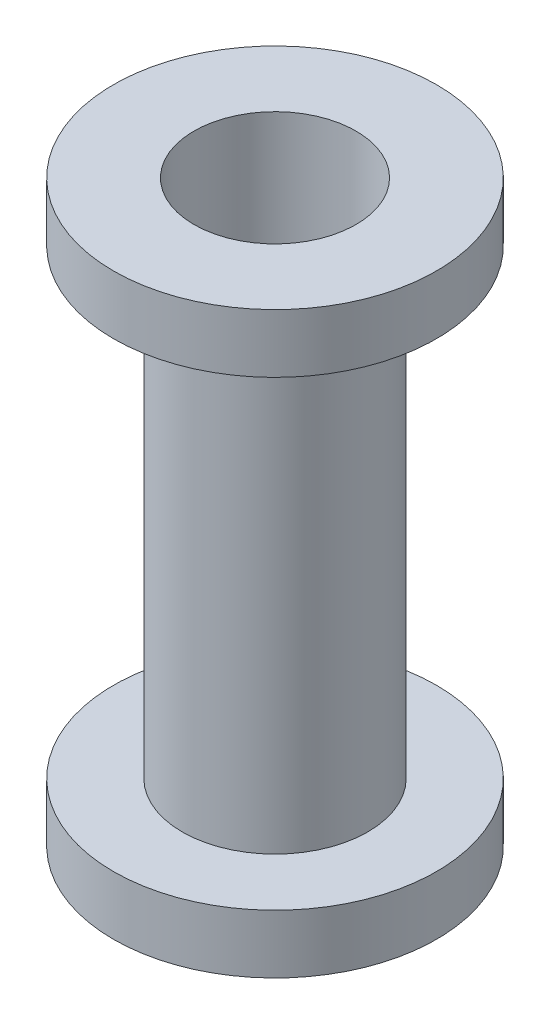
ISO-10303-21;
HEADER;
FILE_DESCRIPTION(('STEP AP214'),'2;1');
FILE_NAME('part.step','',(''),(''),'','','');
FILE_SCHEMA(('AUTOMOTIVE_DESIGN { 1 0 10303 214 1 1 1 1 }'));
ENDSEC;
DATA;
#1=APPLICATION_CONTEXT('core data for automotive mechanical design processes');
#2=APPLICATION_PROTOCOL_DEFINITION('international standard','automotive_design',2000,#1);
#3=PRODUCT_CONTEXT('',#1,'mechanical');
#4=PRODUCT('Part','Part','',(#3));
#5=PRODUCT_RELATED_PRODUCT_CATEGORY('part','',(#4));
#6=PRODUCT_DEFINITION_FORMATION('','',#4);
#7=PRODUCT_DEFINITION_CONTEXT('part definition',#1,'design');
#8=PRODUCT_DEFINITION('design','',#6,#7);
#9=PRODUCT_DEFINITION_SHAPE('','',#8);
#10=(LENGTH_UNIT() NAMED_UNIT(*) SI_UNIT(.MILLI.,.METRE.));
#11=(NAMED_UNIT(*) PLANE_ANGLE_UNIT() SI_UNIT($,.RADIAN.));
#12=(NAMED_UNIT(*) SI_UNIT($,.STERADIAN.) SOLID_ANGLE_UNIT());
#13=UNCERTAINTY_MEASURE_WITH_UNIT(LENGTH_MEASURE(1.E-05),#10,'distance_accuracy_value','');
#14=(GEOMETRIC_REPRESENTATION_CONTEXT(3) GLOBAL_UNCERTAINTY_ASSIGNED_CONTEXT((#13)) GLOBAL_UNIT_ASSIGNED_CONTEXT((#10,
#11,#12)) REPRESENTATION_CONTEXT('',''));
#15=CARTESIAN_POINT('',(0.,0.,0.));
#16=DIRECTION('',(0.,0.,1.));
#17=DIRECTION('',(1.,0.,0.));
#18=AXIS2_PLACEMENT_3D('',#15,#16,#17);
#19=CARTESIAN_POINT('',(0.,125.222,0.));
#20=DIRECTION('',(0.,-1.,0.));
#21=DIRECTION('',(0.,0.,-1.));
#22=AXIS2_PLACEMENT_3D('',#19,#20,#21);
#23=CYLINDRICAL_SURFACE('',#22,20.066);
#24=CARTESIAN_POINT('',(0.,112.522,0.));
#25=DIRECTION('',(0.,1.,0.));
#26=DIRECTION('',(0.,0.,1.));
#27=AXIS2_PLACEMENT_3D('',#24,#25,#26);
#28=CIRCLE('',#27,20.066);
#29=CARTESIAN_POINT('',(0.,112.522,20.066));
#30=VERTEX_POINT('',#29);
#31=EDGE_CURVE('E37',#30,#30,#28,.T.);
#32=ORIENTED_EDGE('',*,*,#31,.F.);
#33=EDGE_LOOP('',(#32));
#34=FACE_BOUND('',#33,.T.);
#35=CARTESIAN_POINT('',(0.,12.7,0.));
#36=DIRECTION('',(0.,-1.,0.));
#37=DIRECTION('',(0.,0.,-1.));
#38=AXIS2_PLACEMENT_3D('',#35,#36,#37);
#39=CIRCLE('',#38,20.066);
#40=CARTESIAN_POINT('',(0.,12.7,-20.066));
#41=VERTEX_POINT('',#40);
#42=EDGE_CURVE('E10',#41,#41,#39,.T.);
#43=ORIENTED_EDGE('',*,*,#42,.F.);
#44=EDGE_LOOP('',(#43));
#45=FACE_BOUND('',#44,.T.);
#46=ADVANCED_FACE('F30',(#34,#45),#23,.T.);
#47=CARTESIAN_POINT('',(0.,125.222,0.));
#48=DIRECTION('',(0.,1.,0.));
#49=DIRECTION('',(0.,0.,1.));
#50=AXIS2_PLACEMENT_3D('',#47,#48,#49);
#51=PLANE('',#50);
#52=CARTESIAN_POINT('',(0.,125.222,0.));
#53=DIRECTION('',(0.,1.,0.));
#54=DIRECTION('',(0.,0.,1.));
#55=AXIS2_PLACEMENT_3D('',#52,#53,#54);
#56=CIRCLE('',#55,17.526);
#57=CARTESIAN_POINT('',(0.,125.222,17.526));
#58=VERTEX_POINT('',#57);
#59=EDGE_CURVE('E42',#58,#58,#56,.T.);
#60=ORIENTED_EDGE('',*,*,#59,.F.);
#61=EDGE_LOOP('',(#60));
#62=FACE_BOUND('',#61,.T.);
#63=CARTESIAN_POINT('',(0.,125.222,0.));
#64=DIRECTION('',(0.,1.,0.));
#65=DIRECTION('',(0.,0.,1.));
#66=AXIS2_PLACEMENT_3D('',#63,#64,#65);
#67=CIRCLE('',#66,34.925);
#68=CARTESIAN_POINT('',(0.,125.222,34.925));
#69=VERTEX_POINT('',#68);
#70=EDGE_CURVE('E51',#69,#69,#67,.T.);
#71=ORIENTED_EDGE('',*,*,#70,.T.);
#72=EDGE_LOOP('',(#71));
#73=FACE_BOUND('',#72,.T.);
#74=ADVANCED_FACE('F74',(#62,#73),#51,.T.);
#75=CARTESIAN_POINT('',(0.,0.,0.));
#76=DIRECTION('',(0.,1.,0.));
#77=DIRECTION('',(0.,0.,1.));
#78=AXIS2_PLACEMENT_3D('',#75,#76,#77);
#79=PLANE('',#78);
#80=CARTESIAN_POINT('',(0.,0.,0.));
#81=DIRECTION('',(0.,1.,0.));
#82=DIRECTION('',(0.,0.,1.));
#83=AXIS2_PLACEMENT_3D('',#80,#81,#82);
#84=CIRCLE('',#83,17.526);
#85=CARTESIAN_POINT('',(0.,0.,17.526));
#86=VERTEX_POINT('',#85);
#87=EDGE_CURVE('E33',#86,#86,#84,.T.);
#88=ORIENTED_EDGE('',*,*,#87,.T.);
#89=EDGE_LOOP('',(#88));
#90=FACE_BOUND('',#89,.T.);
#91=CARTESIAN_POINT('',(0.,0.,0.));
#92=DIRECTION('',(0.,-1.,0.));
#93=DIRECTION('',(0.,0.,-1.));
#94=AXIS2_PLACEMENT_3D('',#91,#92,#93);
#95=CIRCLE('',#94,34.925);
#96=CARTESIAN_POINT('',(0.,0.,-34.925));
#97=VERTEX_POINT('',#96);
#98=EDGE_CURVE('E46',#97,#97,#95,.T.);
#99=ORIENTED_EDGE('',*,*,#98,.T.);
#100=EDGE_LOOP('',(#99));
#101=FACE_BOUND('',#100,.T.);
#102=ADVANCED_FACE('F60',(#90,#101),#79,.F.);
#103=CARTESIAN_POINT('',(0.,125.222,0.));
#104=DIRECTION('',(0.,-1.,0.));
#105=DIRECTION('',(0.,0.,-1.));
#106=AXIS2_PLACEMENT_3D('',#103,#104,#105);
#107=CYLINDRICAL_SURFACE('',#106,17.526);
#108=ORIENTED_EDGE('',*,*,#87,.F.);
#109=EDGE_LOOP('',(#108));
#110=FACE_BOUND('',#109,.T.);
#111=ORIENTED_EDGE('',*,*,#59,.T.);
#112=EDGE_LOOP('',(#111));
#113=FACE_BOUND('',#112,.T.);
#114=ADVANCED_FACE('F63',(#110,#113),#107,.F.);
#115=CARTESIAN_POINT('',(0.,112.522,0.));
#116=DIRECTION('',(0.,1.,0.));
#117=DIRECTION('',(0.,0.,1.));
#118=AXIS2_PLACEMENT_3D('',#115,#116,#117);
#119=PLANE('',#118);
#120=CARTESIAN_POINT('',(0.,112.522,0.));
#121=DIRECTION('',(0.,1.,0.));
#122=DIRECTION('',(0.,0.,1.));
#123=AXIS2_PLACEMENT_3D('',#120,#121,#122);
#124=CIRCLE('',#123,34.925);
#125=CARTESIAN_POINT('',(0.,112.522,34.925));
#126=VERTEX_POINT('',#125);
#127=EDGE_CURVE('E48',#126,#126,#124,.T.);
#128=ORIENTED_EDGE('',*,*,#127,.F.);
#129=EDGE_LOOP('',(#128));
#130=FACE_BOUND('',#129,.T.);
#131=ORIENTED_EDGE('',*,*,#31,.T.);
#132=EDGE_LOOP('',(#131));
#133=FACE_BOUND('',#132,.T.);
#134=ADVANCED_FACE('F65',(#130,#133),#119,.F.);
#135=CARTESIAN_POINT('',(0.,112.522,0.));
#136=DIRECTION('',(0.,1.,0.));
#137=DIRECTION('',(0.,0.,1.));
#138=AXIS2_PLACEMENT_3D('',#135,#136,#137);
#139=CYLINDRICAL_SURFACE('',#138,34.925);
#140=ORIENTED_EDGE('',*,*,#127,.T.);
#141=EDGE_LOOP('',(#140));
#142=FACE_BOUND('',#141,.T.);
#143=ORIENTED_EDGE('',*,*,#70,.F.);
#144=EDGE_LOOP('',(#143));
#145=FACE_BOUND('',#144,.T.);
#146=ADVANCED_FACE('F71',(#142,#145),#139,.T.);
#147=CARTESIAN_POINT('',(0.,12.7,0.));
#148=DIRECTION('',(0.,-1.,0.));
#149=DIRECTION('',(0.,0.,-1.));
#150=AXIS2_PLACEMENT_3D('',#147,#148,#149);
#151=PLANE('',#150);
#152=CARTESIAN_POINT('',(0.,12.7,0.));
#153=DIRECTION('',(0.,-1.,0.));
#154=DIRECTION('',(0.,0.,-1.));
#155=AXIS2_PLACEMENT_3D('',#152,#153,#154);
#156=CIRCLE('',#155,34.925);
#157=CARTESIAN_POINT('',(0.,12.7,-34.925));
#158=VERTEX_POINT('',#157);
#159=EDGE_CURVE('E53',#158,#158,#156,.T.);
#160=ORIENTED_EDGE('',*,*,#159,.F.);
#161=EDGE_LOOP('',(#160));
#162=FACE_BOUND('',#161,.T.);
#163=ORIENTED_EDGE('',*,*,#42,.T.);
#164=EDGE_LOOP('',(#163));
#165=FACE_BOUND('',#164,.T.);
#166=ADVANCED_FACE('F92',(#162,#165),#151,.F.);
#167=CARTESIAN_POINT('',(0.,12.7,0.));
#168=DIRECTION('',(0.,-1.,0.));
#169=DIRECTION('',(0.,0.,-1.));
#170=AXIS2_PLACEMENT_3D('',#167,#168,#169);
#171=CYLINDRICAL_SURFACE('',#170,34.925);
#172=ORIENTED_EDGE('',*,*,#159,.T.);
#173=EDGE_LOOP('',(#172));
#174=FACE_BOUND('',#173,.T.);
#175=ORIENTED_EDGE('',*,*,#98,.F.);
#176=EDGE_LOOP('',(#175));
#177=FACE_BOUND('',#176,.T.);
#178=ADVANCED_FACE('F97',(#174,#177),#171,.T.);
#179=CLOSED_SHELL('',(#46,#74,#102,#114,#134,#146,#166,#178));
#180=MANIFOLD_SOLID_BREP('B2',#179);
#181=ADVANCED_BREP_SHAPE_REPRESENTATION('',(#18,#180),#14);
#182=SHAPE_DEFINITION_REPRESENTATION(#9,#181);
ENDSEC;
END-ISO-10303-21;
